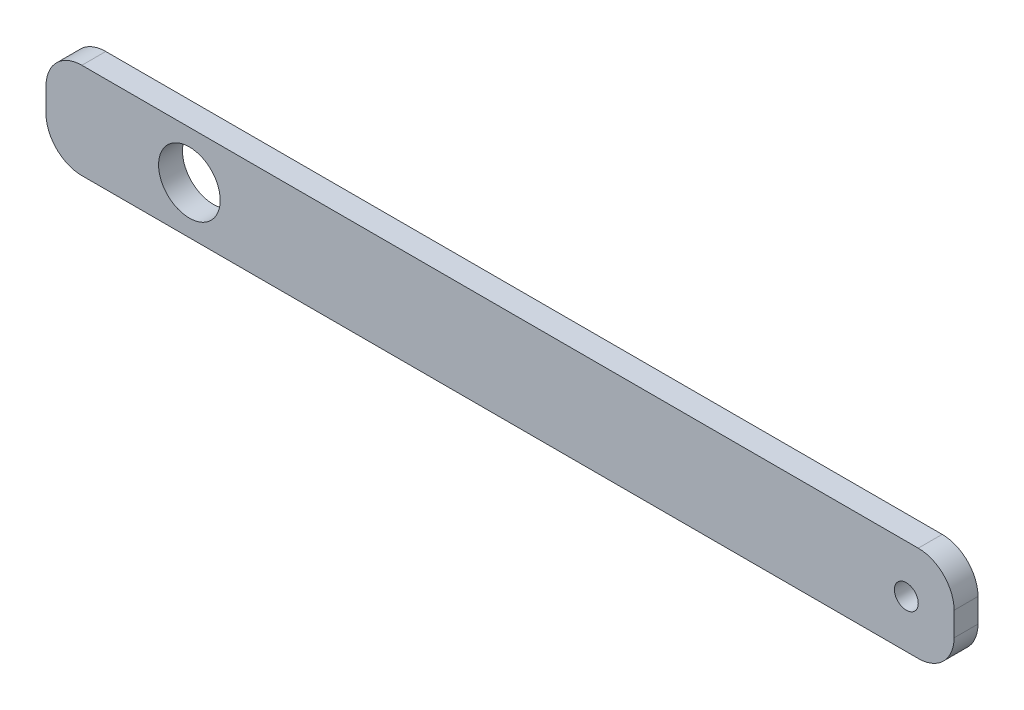
ISO-10303-21;
HEADER;
FILE_DESCRIPTION(('STEP AP214'),'2;1');
FILE_NAME('part.step','',(''),(''),'','','');
FILE_SCHEMA(('AUTOMOTIVE_DESIGN { 1 0 10303 214 1 1 1 1 }'));
ENDSEC;
DATA;
#1=APPLICATION_CONTEXT('core data for automotive mechanical design processes');
#2=APPLICATION_PROTOCOL_DEFINITION('international standard','automotive_design',2000,#1);
#3=PRODUCT_CONTEXT('',#1,'mechanical');
#4=PRODUCT('Part','Part','',(#3));
#5=PRODUCT_RELATED_PRODUCT_CATEGORY('part','',(#4));
#6=PRODUCT_DEFINITION_FORMATION('','',#4);
#7=PRODUCT_DEFINITION_CONTEXT('part definition',#1,'design');
#8=PRODUCT_DEFINITION('design','',#6,#7);
#9=PRODUCT_DEFINITION_SHAPE('','',#8);
#10=(LENGTH_UNIT() NAMED_UNIT(*) SI_UNIT(.MILLI.,.METRE.));
#11=(NAMED_UNIT(*) PLANE_ANGLE_UNIT() SI_UNIT($,.RADIAN.));
#12=(NAMED_UNIT(*) SI_UNIT($,.STERADIAN.) SOLID_ANGLE_UNIT());
#13=UNCERTAINTY_MEASURE_WITH_UNIT(LENGTH_MEASURE(1.E-05),#10,'distance_accuracy_value','');
#14=(GEOMETRIC_REPRESENTATION_CONTEXT(3) GLOBAL_UNCERTAINTY_ASSIGNED_CONTEXT((#13)) GLOBAL_UNIT_ASSIGNED_CONTEXT((#10,
#11,#12)) REPRESENTATION_CONTEXT('',''));
#15=CARTESIAN_POINT('',(0.,0.,0.));
#16=DIRECTION('',(0.,0.,1.));
#17=DIRECTION('',(1.,0.,0.));
#18=AXIS2_PLACEMENT_3D('',#15,#16,#17);
#19=CARTESIAN_POINT('',(0.,0.,5.));
#20=DIRECTION('',(0.,0.,-1.));
#21=DIRECTION('',(-1.,0.,0.));
#22=AXIS2_PLACEMENT_3D('',#19,#20,#21);
#23=PLANE('',#22);
#24=CARTESIAN_POINT('',(-65.,0.,5.));
#25=DIRECTION('',(0.,0.,1.));
#26=DIRECTION('',(1.,0.,0.));
#27=AXIS2_PLACEMENT_3D('',#24,#25,#26);
#28=CIRCLE('',#27,6.45);
#29=CARTESIAN_POINT('',(-58.55,0.,5.));
#30=VERTEX_POINT('',#29);
#31=EDGE_CURVE('E134',#30,#30,#28,.T.);
#32=ORIENTED_EDGE('',*,*,#31,.F.);
#33=EDGE_LOOP('',(#32));
#34=FACE_BOUND('',#33,.T.);
#35=DIRECTION('',(0.,-1.,0.));
#36=VECTOR('',#35,1.);
#37=CARTESIAN_POINT('',(-95.,-10.,5.));
#38=LINE('',#37,#36);
#39=CARTESIAN_POINT('',(-95.,2.49999999999995,5.));
#40=VERTEX_POINT('',#39);
#41=CARTESIAN_POINT('',(-95.,-2.50000000000003,5.));
#42=VERTEX_POINT('',#41);
#43=EDGE_CURVE('E139',#40,#42,#38,.T.);
#44=ORIENTED_EDGE('',*,*,#43,.T.);
#45=CARTESIAN_POINT('',(-87.5,-2.50000000000003,5.));
#46=DIRECTION('',(0.,0.,-1.));
#47=DIRECTION('',(-1.,0.,0.));
#48=AXIS2_PLACEMENT_3D('',#45,#46,#47);
#49=CIRCLE('',#48,7.5);
#50=CARTESIAN_POINT('',(-87.5,-10.,5.));
#51=VERTEX_POINT('',#50);
#52=EDGE_CURVE('E153',#42,#51,#49,.F.);
#53=ORIENTED_EDGE('',*,*,#52,.T.);
#54=DIRECTION('',(1.,0.,0.));
#55=VECTOR('',#54,1.);
#56=CARTESIAN_POINT('',(-95.,-10.,5.));
#57=LINE('',#56,#55);
#58=CARTESIAN_POINT('',(87.5,-10.,5.));
#59=VERTEX_POINT('',#58);
#60=EDGE_CURVE('E120',#51,#59,#57,.T.);
#61=ORIENTED_EDGE('',*,*,#60,.T.);
#62=CARTESIAN_POINT('',(87.5,-2.50000000000002,5.));
#63=DIRECTION('',(0.,0.,-1.));
#64=DIRECTION('',(-1.,0.,0.));
#65=AXIS2_PLACEMENT_3D('',#62,#63,#64);
#66=CIRCLE('',#65,7.5);
#67=CARTESIAN_POINT('',(95.,-2.50000000000002,5.));
#68=VERTEX_POINT('',#67);
#69=EDGE_CURVE('E149',#59,#68,#66,.F.);
#70=ORIENTED_EDGE('',*,*,#69,.T.);
#71=DIRECTION('',(0.,1.,0.));
#72=VECTOR('',#71,1.);
#73=CARTESIAN_POINT('',(95.,-10.,5.));
#74=LINE('',#73,#72);
#75=CARTESIAN_POINT('',(95.,2.49999999999998,5.));
#76=VERTEX_POINT('',#75);
#77=EDGE_CURVE('E162',#68,#76,#74,.T.);
#78=ORIENTED_EDGE('',*,*,#77,.T.);
#79=CARTESIAN_POINT('',(87.5,2.49999999999998,5.));
#80=DIRECTION('',(0.,0.,-1.));
#81=DIRECTION('',(-1.,0.,0.));
#82=AXIS2_PLACEMENT_3D('',#79,#80,#81);
#83=CIRCLE('',#82,7.5);
#84=CARTESIAN_POINT('',(87.5,9.99999999999998,5.));
#85=VERTEX_POINT('',#84);
#86=EDGE_CURVE('E55',#76,#85,#83,.F.);
#87=ORIENTED_EDGE('',*,*,#86,.T.);
#88=DIRECTION('',(-1.,0.,0.));
#89=VECTOR('',#88,1.);
#90=CARTESIAN_POINT('',(-95.,9.99999999999995,5.));
#91=LINE('',#90,#89);
#92=CARTESIAN_POINT('',(-87.5,9.99999999999995,5.));
#93=VERTEX_POINT('',#92);
#94=EDGE_CURVE('E140',#85,#93,#91,.T.);
#95=ORIENTED_EDGE('',*,*,#94,.T.);
#96=CARTESIAN_POINT('',(-87.5,2.49999999999995,5.));
#97=DIRECTION('',(0.,0.,-1.));
#98=DIRECTION('',(-1.,0.,0.));
#99=AXIS2_PLACEMENT_3D('',#96,#97,#98);
#100=CIRCLE('',#99,7.5);
#101=EDGE_CURVE('E151',#93,#40,#100,.F.);
#102=ORIENTED_EDGE('',*,*,#101,.T.);
#103=EDGE_LOOP('',(#44,#53,#61,#70,#78,#87,#95,#102));
#104=FACE_BOUND('',#103,.T.);
#105=CARTESIAN_POINT('',(85.,0.,5.));
#106=DIRECTION('',(0.,0.,1.));
#107=DIRECTION('',(1.,0.,0.));
#108=AXIS2_PLACEMENT_3D('',#105,#106,#107);
#109=CIRCLE('',#108,2.50000000000001);
#110=CARTESIAN_POINT('',(87.5,0.,5.));
#111=VERTEX_POINT('',#110);
#112=EDGE_CURVE('E185',#111,#111,#109,.T.);
#113=ORIENTED_EDGE('',*,*,#112,.F.);
#114=EDGE_LOOP('',(#113));
#115=FACE_BOUND('',#114,.T.);
#116=ADVANCED_FACE('F33',(#34,#104,#115),#23,.F.);
#117=CARTESIAN_POINT('',(0.,0.,0.));
#118=DIRECTION('',(0.,0.,-1.));
#119=DIRECTION('',(-1.,0.,0.));
#120=AXIS2_PLACEMENT_3D('',#117,#118,#119);
#121=PLANE('',#120);
#122=CARTESIAN_POINT('',(-65.,0.,0.));
#123=DIRECTION('',(0.,0.,1.));
#124=DIRECTION('',(1.,0.,0.));
#125=AXIS2_PLACEMENT_3D('',#122,#123,#124);
#126=CIRCLE('',#125,6.45);
#127=CARTESIAN_POINT('',(-58.55,0.,0.));
#128=VERTEX_POINT('',#127);
#129=EDGE_CURVE('E182',#128,#128,#126,.T.);
#130=ORIENTED_EDGE('',*,*,#129,.T.);
#131=EDGE_LOOP('',(#130));
#132=FACE_BOUND('',#131,.T.);
#133=DIRECTION('',(1.,0.,0.));
#134=VECTOR('',#133,1.);
#135=CARTESIAN_POINT('',(-95.,-10.,0.));
#136=LINE('',#135,#134);
#137=CARTESIAN_POINT('',(-87.5,-10.,0.));
#138=VERTEX_POINT('',#137);
#139=CARTESIAN_POINT('',(87.5,-10.,0.));
#140=VERTEX_POINT('',#139);
#141=EDGE_CURVE('E117',#138,#140,#136,.T.);
#142=ORIENTED_EDGE('',*,*,#141,.F.);
#143=CARTESIAN_POINT('',(-87.5,-2.50000000000003,0.));
#144=DIRECTION('',(0.,0.,-1.));
#145=DIRECTION('',(-1.,0.,0.));
#146=AXIS2_PLACEMENT_3D('',#143,#144,#145);
#147=CIRCLE('',#146,7.5);
#148=CARTESIAN_POINT('',(-95.,-2.50000000000003,0.));
#149=VERTEX_POINT('',#148);
#150=EDGE_CURVE('E100',#138,#149,#147,.T.);
#151=ORIENTED_EDGE('',*,*,#150,.T.);
#152=DIRECTION('',(0.,-1.,0.));
#153=VECTOR('',#152,1.);
#154=CARTESIAN_POINT('',(-95.,-10.,0.));
#155=LINE('',#154,#153);
#156=CARTESIAN_POINT('',(-95.,2.49999999999995,0.));
#157=VERTEX_POINT('',#156);
#158=EDGE_CURVE('E129',#157,#149,#155,.T.);
#159=ORIENTED_EDGE('',*,*,#158,.F.);
#160=CARTESIAN_POINT('',(-87.5,2.49999999999995,0.));
#161=DIRECTION('',(0.,0.,-1.));
#162=DIRECTION('',(-1.,0.,0.));
#163=AXIS2_PLACEMENT_3D('',#160,#161,#162);
#164=CIRCLE('',#163,7.5);
#165=CARTESIAN_POINT('',(-87.5,9.99999999999995,0.));
#166=VERTEX_POINT('',#165);
#167=EDGE_CURVE('E111',#157,#166,#164,.T.);
#168=ORIENTED_EDGE('',*,*,#167,.T.);
#169=DIRECTION('',(-1.,0.,0.));
#170=VECTOR('',#169,1.);
#171=CARTESIAN_POINT('',(-95.,9.99999999999995,0.));
#172=LINE('',#171,#170);
#173=CARTESIAN_POINT('',(87.5,9.99999999999998,0.));
#174=VERTEX_POINT('',#173);
#175=EDGE_CURVE('E132',#174,#166,#172,.T.);
#176=ORIENTED_EDGE('',*,*,#175,.F.);
#177=CARTESIAN_POINT('',(87.5,2.49999999999998,0.));
#178=DIRECTION('',(0.,0.,-1.));
#179=DIRECTION('',(-1.,0.,0.));
#180=AXIS2_PLACEMENT_3D('',#177,#178,#179);
#181=CIRCLE('',#180,7.5);
#182=CARTESIAN_POINT('',(95.,2.49999999999998,0.));
#183=VERTEX_POINT('',#182);
#184=EDGE_CURVE('E121',#174,#183,#181,.T.);
#185=ORIENTED_EDGE('',*,*,#184,.T.);
#186=DIRECTION('',(0.,1.,0.));
#187=VECTOR('',#186,1.);
#188=CARTESIAN_POINT('',(95.,-10.,0.));
#189=LINE('',#188,#187);
#190=CARTESIAN_POINT('',(95.,-2.50000000000002,0.));
#191=VERTEX_POINT('',#190);
#192=EDGE_CURVE('E128',#191,#183,#189,.T.);
#193=ORIENTED_EDGE('',*,*,#192,.F.);
#194=CARTESIAN_POINT('',(87.5,-2.50000000000002,0.));
#195=DIRECTION('',(0.,0.,-1.));
#196=DIRECTION('',(-1.,0.,0.));
#197=AXIS2_PLACEMENT_3D('',#194,#195,#196);
#198=CIRCLE('',#197,7.5);
#199=EDGE_CURVE('E127',#191,#140,#198,.T.);
#200=ORIENTED_EDGE('',*,*,#199,.T.);
#201=EDGE_LOOP('',(#142,#151,#159,#168,#176,#185,#193,#200));
#202=FACE_BOUND('',#201,.T.);
#203=CARTESIAN_POINT('',(85.,0.,0.));
#204=DIRECTION('',(0.,0.,1.));
#205=DIRECTION('',(1.,0.,0.));
#206=AXIS2_PLACEMENT_3D('',#203,#204,#205);
#207=CIRCLE('',#206,2.50000000000001);
#208=CARTESIAN_POINT('',(87.5,0.,0.));
#209=VERTEX_POINT('',#208);
#210=EDGE_CURVE('E188',#209,#209,#207,.T.);
#211=ORIENTED_EDGE('',*,*,#210,.T.);
#212=EDGE_LOOP('',(#211));
#213=FACE_BOUND('',#212,.T.);
#214=ADVANCED_FACE('F124',(#132,#202,#213),#121,.T.);
#215=CARTESIAN_POINT('',(-95.,-10.,5.));
#216=DIRECTION('',(1.,0.,0.));
#217=DIRECTION('',(0.,0.,-1.));
#218=AXIS2_PLACEMENT_3D('',#215,#216,#217);
#219=PLANE('',#218);
#220=ORIENTED_EDGE('',*,*,#158,.T.);
#221=DIRECTION('',(0.,0.,-1.));
#222=VECTOR('',#221,1.);
#223=CARTESIAN_POINT('',(-95.,-2.50000000000003,5.));
#224=LINE('',#223,#222);
#225=EDGE_CURVE('E105',#149,#42,#224,.F.);
#226=ORIENTED_EDGE('',*,*,#225,.T.);
#227=ORIENTED_EDGE('',*,*,#43,.F.);
#228=DIRECTION('',(0.,0.,-1.));
#229=VECTOR('',#228,1.);
#230=CARTESIAN_POINT('',(-95.,2.49999999999995,5.));
#231=LINE('',#230,#229);
#232=EDGE_CURVE('E110',#40,#157,#231,.T.);
#233=ORIENTED_EDGE('',*,*,#232,.T.);
#234=EDGE_LOOP('',(#220,#226,#227,#233));
#235=FACE_BOUND('',#234,.T.);
#236=ADVANCED_FACE('F178',(#235),#219,.F.);
#237=CARTESIAN_POINT('',(-95.,-10.,5.));
#238=DIRECTION('',(0.,1.,0.));
#239=DIRECTION('',(-1.,0.,0.));
#240=AXIS2_PLACEMENT_3D('',#237,#238,#239);
#241=PLANE('',#240);
#242=ORIENTED_EDGE('',*,*,#60,.F.);
#243=DIRECTION('',(0.,0.,-1.));
#244=VECTOR('',#243,1.);
#245=CARTESIAN_POINT('',(-87.5,-10.,5.));
#246=LINE('',#245,#244);
#247=EDGE_CURVE('E104',#51,#138,#246,.T.);
#248=ORIENTED_EDGE('',*,*,#247,.T.);
#249=ORIENTED_EDGE('',*,*,#141,.T.);
#250=DIRECTION('',(0.,0.,-1.));
#251=VECTOR('',#250,1.);
#252=CARTESIAN_POINT('',(87.5,-10.,5.));
#253=LINE('',#252,#251);
#254=EDGE_CURVE('E122',#140,#59,#253,.F.);
#255=ORIENTED_EDGE('',*,*,#254,.T.);
#256=EDGE_LOOP('',(#242,#248,#249,#255));
#257=FACE_BOUND('',#256,.T.);
#258=ADVANCED_FACE('F116',(#257),#241,.F.);
#259=CARTESIAN_POINT('',(95.,-10.,5.));
#260=DIRECTION('',(-1.,0.,0.));
#261=DIRECTION('',(0.,0.,1.));
#262=AXIS2_PLACEMENT_3D('',#259,#260,#261);
#263=PLANE('',#262);
#264=ORIENTED_EDGE('',*,*,#77,.F.);
#265=DIRECTION('',(0.,0.,-1.));
#266=VECTOR('',#265,1.);
#267=CARTESIAN_POINT('',(95.,-2.50000000000002,5.));
#268=LINE('',#267,#266);
#269=EDGE_CURVE('E11',#68,#191,#268,.T.);
#270=ORIENTED_EDGE('',*,*,#269,.T.);
#271=ORIENTED_EDGE('',*,*,#192,.T.);
#272=DIRECTION('',(0.,0.,-1.));
#273=VECTOR('',#272,1.);
#274=CARTESIAN_POINT('',(95.,2.49999999999998,5.));
#275=LINE('',#274,#273);
#276=EDGE_CURVE('E41',#183,#76,#275,.F.);
#277=ORIENTED_EDGE('',*,*,#276,.T.);
#278=EDGE_LOOP('',(#264,#270,#271,#277));
#279=FACE_BOUND('',#278,.T.);
#280=ADVANCED_FACE('F161',(#279),#263,.F.);
#281=CARTESIAN_POINT('',(-95.,9.99999999999995,5.));
#282=DIRECTION('',(0.,-1.,0.));
#283=DIRECTION('',(1.,0.,0.));
#284=AXIS2_PLACEMENT_3D('',#281,#282,#283);
#285=PLANE('',#284);
#286=ORIENTED_EDGE('',*,*,#175,.T.);
#287=DIRECTION('',(0.,0.,-1.));
#288=VECTOR('',#287,1.);
#289=CARTESIAN_POINT('',(-87.5,9.99999999999995,5.));
#290=LINE('',#289,#288);
#291=EDGE_CURVE('E48',#166,#93,#290,.F.);
#292=ORIENTED_EDGE('',*,*,#291,.T.);
#293=ORIENTED_EDGE('',*,*,#94,.F.);
#294=DIRECTION('',(0.,0.,-1.));
#295=VECTOR('',#294,1.);
#296=CARTESIAN_POINT('',(87.5,9.99999999999998,5.));
#297=LINE('',#296,#295);
#298=EDGE_CURVE('E155',#85,#174,#297,.T.);
#299=ORIENTED_EDGE('',*,*,#298,.T.);
#300=EDGE_LOOP('',(#286,#292,#293,#299));
#301=FACE_BOUND('',#300,.T.);
#302=ADVANCED_FACE('F171',(#301),#285,.F.);
#303=CARTESIAN_POINT('',(-65.,0.,5.));
#304=DIRECTION('',(0.,0.,-1.));
#305=DIRECTION('',(-1.,0.,0.));
#306=AXIS2_PLACEMENT_3D('',#303,#304,#305);
#307=CYLINDRICAL_SURFACE('',#306,6.45);
#308=ORIENTED_EDGE('',*,*,#31,.T.);
#309=EDGE_LOOP('',(#308));
#310=FACE_BOUND('',#309,.T.);
#311=ORIENTED_EDGE('',*,*,#129,.F.);
#312=EDGE_LOOP('',(#311));
#313=FACE_BOUND('',#312,.T.);
#314=ADVANCED_FACE('F206',(#310,#313),#307,.F.);
#315=CARTESIAN_POINT('',(85.,0.,5.));
#316=DIRECTION('',(0.,0.,-1.));
#317=DIRECTION('',(-1.,0.,0.));
#318=AXIS2_PLACEMENT_3D('',#315,#316,#317);
#319=CYLINDRICAL_SURFACE('',#318,2.50000000000001);
#320=ORIENTED_EDGE('',*,*,#112,.T.);
#321=EDGE_LOOP('',(#320));
#322=FACE_BOUND('',#321,.T.);
#323=ORIENTED_EDGE('',*,*,#210,.F.);
#324=EDGE_LOOP('',(#323));
#325=FACE_BOUND('',#324,.T.);
#326=ADVANCED_FACE('F194',(#322,#325),#319,.F.);
#327=CARTESIAN_POINT('',(-87.5,-2.50000000000003,5.));
#328=DIRECTION('',(0.,0.,-1.));
#329=DIRECTION('',(-1.,0.,0.));
#330=AXIS2_PLACEMENT_3D('',#327,#328,#329);
#331=CYLINDRICAL_SURFACE('',#330,7.5);
#332=ORIENTED_EDGE('',*,*,#52,.F.);
#333=ORIENTED_EDGE('',*,*,#225,.F.);
#334=ORIENTED_EDGE('',*,*,#150,.F.);
#335=ORIENTED_EDGE('',*,*,#247,.F.);
#336=EDGE_LOOP('',(#332,#333,#334,#335));
#337=FACE_BOUND('',#336,.T.);
#338=ADVANCED_FACE('F103',(#337),#331,.T.);
#339=CARTESIAN_POINT('',(-87.5,2.49999999999995,5.));
#340=DIRECTION('',(0.,0.,-1.));
#341=DIRECTION('',(-1.,0.,0.));
#342=AXIS2_PLACEMENT_3D('',#339,#340,#341);
#343=CYLINDRICAL_SURFACE('',#342,7.5);
#344=ORIENTED_EDGE('',*,*,#101,.F.);
#345=ORIENTED_EDGE('',*,*,#291,.F.);
#346=ORIENTED_EDGE('',*,*,#167,.F.);
#347=ORIENTED_EDGE('',*,*,#232,.F.);
#348=EDGE_LOOP('',(#344,#345,#346,#347));
#349=FACE_BOUND('',#348,.T.);
#350=ADVANCED_FACE('F175',(#349),#343,.T.);
#351=CARTESIAN_POINT('',(87.5,-2.50000000000002,5.));
#352=DIRECTION('',(0.,0.,-1.));
#353=DIRECTION('',(-1.,0.,0.));
#354=AXIS2_PLACEMENT_3D('',#351,#352,#353);
#355=CYLINDRICAL_SURFACE('',#354,7.5);
#356=ORIENTED_EDGE('',*,*,#69,.F.);
#357=ORIENTED_EDGE('',*,*,#254,.F.);
#358=ORIENTED_EDGE('',*,*,#199,.F.);
#359=ORIENTED_EDGE('',*,*,#269,.F.);
#360=EDGE_LOOP('',(#356,#357,#358,#359));
#361=FACE_BOUND('',#360,.T.);
#362=ADVANCED_FACE('F220',(#361),#355,.T.);
#363=CARTESIAN_POINT('',(87.5,2.49999999999998,5.));
#364=DIRECTION('',(0.,0.,-1.));
#365=DIRECTION('',(-1.,0.,0.));
#366=AXIS2_PLACEMENT_3D('',#363,#364,#365);
#367=CYLINDRICAL_SURFACE('',#366,7.5);
#368=ORIENTED_EDGE('',*,*,#86,.F.);
#369=ORIENTED_EDGE('',*,*,#276,.F.);
#370=ORIENTED_EDGE('',*,*,#184,.F.);
#371=ORIENTED_EDGE('',*,*,#298,.F.);
#372=EDGE_LOOP('',(#368,#369,#370,#371));
#373=FACE_BOUND('',#372,.T.);
#374=ADVANCED_FACE('F35',(#373),#367,.T.);
#375=CLOSED_SHELL('',(#116,#214,#236,#258,#280,#302,#314,#326,#338,#350,#362,#374));
#376=MANIFOLD_SOLID_BREP('B2',#375);
#377=ADVANCED_BREP_SHAPE_REPRESENTATION('',(#18,#376),#14);
#378=SHAPE_DEFINITION_REPRESENTATION(#9,#377);
ENDSEC;
END-ISO-10303-21;
